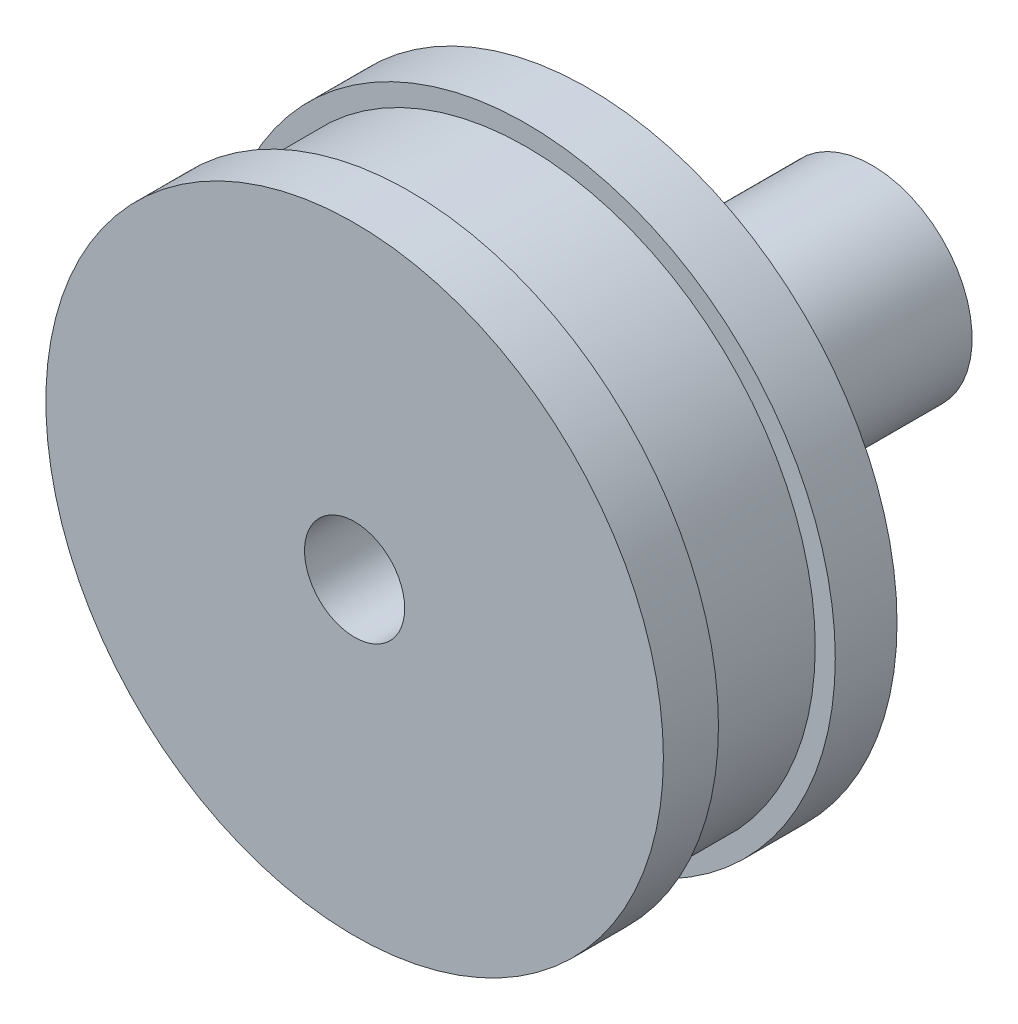
ISO-10303-21;
HEADER;
FILE_DESCRIPTION(('STEP AP214'),'2;1');
FILE_NAME('part.step','',(''),(''),'','','');
FILE_SCHEMA(('AUTOMOTIVE_DESIGN { 1 0 10303 214 1 1 1 1 }'));
ENDSEC;
DATA;
#1=APPLICATION_CONTEXT('core data for automotive mechanical design processes');
#2=APPLICATION_PROTOCOL_DEFINITION('international standard','automotive_design',2000,#1);
#3=PRODUCT_CONTEXT('',#1,'mechanical');
#4=PRODUCT('Part','Part','',(#3));
#5=PRODUCT_RELATED_PRODUCT_CATEGORY('part','',(#4));
#6=PRODUCT_DEFINITION_FORMATION('','',#4);
#7=PRODUCT_DEFINITION_CONTEXT('part definition',#1,'design');
#8=PRODUCT_DEFINITION('design','',#6,#7);
#9=PRODUCT_DEFINITION_SHAPE('','',#8);
#10=(LENGTH_UNIT() NAMED_UNIT(*) SI_UNIT(.MILLI.,.METRE.));
#11=(NAMED_UNIT(*) PLANE_ANGLE_UNIT() SI_UNIT($,.RADIAN.));
#12=(NAMED_UNIT(*) SI_UNIT($,.STERADIAN.) SOLID_ANGLE_UNIT());
#13=UNCERTAINTY_MEASURE_WITH_UNIT(LENGTH_MEASURE(1.E-05),#10,'distance_accuracy_value','');
#14=(GEOMETRIC_REPRESENTATION_CONTEXT(3) GLOBAL_UNCERTAINTY_ASSIGNED_CONTEXT((#13)) GLOBAL_UNIT_ASSIGNED_CONTEXT((#10,
#11,#12)) REPRESENTATION_CONTEXT('',''));
#15=CARTESIAN_POINT('',(0.,0.,0.));
#16=DIRECTION('',(0.,0.,1.));
#17=DIRECTION('',(1.,0.,0.));
#18=AXIS2_PLACEMENT_3D('',#15,#16,#17);
#19=CARTESIAN_POINT('',(0.,0.,14.));
#20=DIRECTION('',(0.,0.,-1.));
#21=DIRECTION('',(-1.,0.,0.));
#22=AXIS2_PLACEMENT_3D('',#19,#20,#21);
#23=CYLINDRICAL_SURFACE('',#22,18.5);
#24=CARTESIAN_POINT('',(0.,0.,0.));
#25=DIRECTION('',(0.,0.,1.));
#26=DIRECTION('',(1.,0.,0.));
#27=AXIS2_PLACEMENT_3D('',#24,#25,#26);
#28=CIRCLE('',#27,18.5);
#29=CARTESIAN_POINT('',(18.5,0.,0.));
#30=VERTEX_POINT('',#29);
#31=EDGE_CURVE('E66',#30,#30,#28,.T.);
#32=ORIENTED_EDGE('',*,*,#31,.T.);
#33=EDGE_LOOP('',(#32));
#34=FACE_BOUND('',#33,.T.);
#35=CARTESIAN_POINT('',(0.,0.,3.7));
#36=DIRECTION('',(0.,0.,1.));
#37=DIRECTION('',(1.,0.,0.));
#38=AXIS2_PLACEMENT_3D('',#35,#36,#37);
#39=CIRCLE('',#38,18.5);
#40=CARTESIAN_POINT('',(18.5,0.,3.7));
#41=VERTEX_POINT('',#40);
#42=EDGE_CURVE('E59',#41,#41,#39,.T.);
#43=ORIENTED_EDGE('',*,*,#42,.F.);
#44=EDGE_LOOP('',(#43));
#45=FACE_BOUND('',#44,.T.);
#46=ADVANCED_FACE('F31',(#34,#45),#23,.T.);
#47=CARTESIAN_POINT('',(0.,0.,14.));
#48=DIRECTION('',(0.,0.,1.));
#49=DIRECTION('',(1.,0.,0.));
#50=AXIS2_PLACEMENT_3D('',#47,#48,#49);
#51=PLANE('',#50);
#52=CARTESIAN_POINT('',(0.,0.,14.));
#53=DIRECTION('',(0.,0.,1.));
#54=DIRECTION('',(1.,0.,0.));
#55=AXIS2_PLACEMENT_3D('',#52,#53,#54);
#56=CIRCLE('',#55,18.5);
#57=CARTESIAN_POINT('',(18.5,0.,14.));
#58=VERTEX_POINT('',#57);
#59=EDGE_CURVE('E43',#58,#58,#56,.T.);
#60=ORIENTED_EDGE('',*,*,#59,.T.);
#61=EDGE_LOOP('',(#60));
#62=FACE_BOUND('',#61,.T.);
#63=CARTESIAN_POINT('',(0.,0.,14.));
#64=DIRECTION('',(0.,0.,1.));
#65=DIRECTION('',(1.,0.,0.));
#66=AXIS2_PLACEMENT_3D('',#63,#64,#65);
#67=CIRCLE('',#66,3.);
#68=CARTESIAN_POINT('',(3.,0.,14.));
#69=VERTEX_POINT('',#68);
#70=EDGE_CURVE('E63',#69,#69,#67,.T.);
#71=ORIENTED_EDGE('',*,*,#70,.F.);
#72=EDGE_LOOP('',(#71));
#73=FACE_BOUND('',#72,.T.);
#74=ADVANCED_FACE('F77',(#62,#73),#51,.T.);
#75=CARTESIAN_POINT('',(0.,0.,0.));
#76=DIRECTION('',(0.,0.,1.));
#77=DIRECTION('',(1.,0.,0.));
#78=AXIS2_PLACEMENT_3D('',#75,#76,#77);
#79=PLANE('',#78);
#80=CARTESIAN_POINT('',(0.,0.,0.));
#81=DIRECTION('',(0.,0.,1.));
#82=DIRECTION('',(1.,0.,0.));
#83=AXIS2_PLACEMENT_3D('',#80,#81,#82);
#84=CIRCLE('',#83,7.);
#85=CARTESIAN_POINT('',(7.,0.,0.));
#86=VERTEX_POINT('',#85);
#87=EDGE_CURVE('E35',#86,#86,#84,.F.);
#88=ORIENTED_EDGE('',*,*,#87,.F.);
#89=EDGE_LOOP('',(#88));
#90=FACE_BOUND('',#89,.T.);
#91=ORIENTED_EDGE('',*,*,#31,.F.);
#92=EDGE_LOOP('',(#91));
#93=FACE_BOUND('',#92,.T.);
#94=ADVANCED_FACE('F75',(#90,#93),#79,.F.);
#95=CARTESIAN_POINT('',(0.,0.,10.7));
#96=DIRECTION('',(0.,0.,1.));
#97=DIRECTION('',(1.,0.,0.));
#98=AXIS2_PLACEMENT_3D('',#95,#96,#97);
#99=CIRCLE('',#98,18.5);
#100=CARTESIAN_POINT('',(18.5,0.,10.7));
#101=VERTEX_POINT('',#100);
#102=EDGE_CURVE('E53',#101,#101,#99,.T.);
#103=ORIENTED_EDGE('',*,*,#102,.T.);
#104=EDGE_LOOP('',(#103));
#105=FACE_BOUND('',#104,.T.);
#106=ORIENTED_EDGE('',*,*,#59,.F.);
#107=EDGE_LOOP('',(#106));
#108=FACE_BOUND('',#107,.T.);
#109=ADVANCED_FACE('F33',(#105,#108),#23,.T.);
#110=CARTESIAN_POINT('',(0.,0.,14.));
#111=DIRECTION('',(0.,0.,-1.));
#112=DIRECTION('',(-1.,0.,0.));
#113=AXIS2_PLACEMENT_3D('',#110,#111,#112);
#114=CYLINDRICAL_SURFACE('',#113,3.);
#115=ORIENTED_EDGE('',*,*,#70,.T.);
#116=EDGE_LOOP('',(#115));
#117=FACE_BOUND('',#116,.T.);
#118=CARTESIAN_POINT('',(0.,0.,0.));
#119=DIRECTION('',(0.,0.,1.));
#120=DIRECTION('',(1.,0.,0.));
#121=AXIS2_PLACEMENT_3D('',#118,#119,#120);
#122=CIRCLE('',#121,3.);
#123=CARTESIAN_POINT('',(3.,0.,0.));
#124=VERTEX_POINT('',#123);
#125=EDGE_CURVE('E62',#124,#124,#122,.T.);
#126=ORIENTED_EDGE('',*,*,#125,.F.);
#127=EDGE_LOOP('',(#126));
#128=FACE_BOUND('',#127,.T.);
#129=ADVANCED_FACE('F83',(#117,#128),#114,.F.);
#130=CARTESIAN_POINT('',(0.,0.,5.5));
#131=DIRECTION('',(0.,0.,1.));
#132=DIRECTION('',(1.,0.,0.));
#133=AXIS2_PLACEMENT_3D('',#130,#131,#132);
#134=CYLINDRICAL_SURFACE('',#133,17.3);
#135=CARTESIAN_POINT('',(0.,0.,10.7));
#136=DIRECTION('',(0.,0.,1.));
#137=DIRECTION('',(1.,0.,0.));
#138=AXIS2_PLACEMENT_3D('',#135,#136,#137);
#139=CIRCLE('',#138,17.3);
#140=CARTESIAN_POINT('',(17.3,0.,10.7));
#141=VERTEX_POINT('',#140);
#142=EDGE_CURVE('E50',#141,#141,#139,.T.);
#143=ORIENTED_EDGE('',*,*,#142,.F.);
#144=EDGE_LOOP('',(#143));
#145=FACE_BOUND('',#144,.T.);
#146=CARTESIAN_POINT('',(0.,0.,3.7));
#147=DIRECTION('',(0.,0.,1.));
#148=DIRECTION('',(1.,0.,0.));
#149=AXIS2_PLACEMENT_3D('',#146,#147,#148);
#150=CIRCLE('',#149,17.3);
#151=CARTESIAN_POINT('',(17.3,0.,3.7));
#152=VERTEX_POINT('',#151);
#153=EDGE_CURVE('E56',#152,#152,#150,.T.);
#154=ORIENTED_EDGE('',*,*,#153,.T.);
#155=EDGE_LOOP('',(#154));
#156=FACE_BOUND('',#155,.T.);
#157=ADVANCED_FACE('F105',(#145,#156),#134,.T.);
#158=CARTESIAN_POINT('',(0.,0.,3.7));
#159=DIRECTION('',(0.,0.,1.));
#160=DIRECTION('',(1.,0.,0.));
#161=AXIS2_PLACEMENT_3D('',#158,#159,#160);
#162=PLANE('',#161);
#163=ORIENTED_EDGE('',*,*,#153,.F.);
#164=EDGE_LOOP('',(#163));
#165=FACE_BOUND('',#164,.T.);
#166=ORIENTED_EDGE('',*,*,#42,.T.);
#167=EDGE_LOOP('',(#166));
#168=FACE_BOUND('',#167,.T.);
#169=ADVANCED_FACE('F119',(#165,#168),#162,.T.);
#170=CARTESIAN_POINT('',(0.,0.,10.7));
#171=DIRECTION('',(0.,0.,1.));
#172=DIRECTION('',(1.,0.,0.));
#173=AXIS2_PLACEMENT_3D('',#170,#171,#172);
#174=PLANE('',#173);
#175=ORIENTED_EDGE('',*,*,#102,.F.);
#176=EDGE_LOOP('',(#175));
#177=FACE_BOUND('',#176,.T.);
#178=ORIENTED_EDGE('',*,*,#142,.T.);
#179=EDGE_LOOP('',(#178));
#180=FACE_BOUND('',#179,.T.);
#181=ADVANCED_FACE('F127',(#177,#180),#174,.F.);
#182=CARTESIAN_POINT('',(0.,0.,0.));
#183=DIRECTION('',(0.,0.,-1.));
#184=DIRECTION('',(-1.,0.,0.));
#185=AXIS2_PLACEMENT_3D('',#182,#183,#184);
#186=PLANE('',#185);
#187=ORIENTED_EDGE('',*,*,#125,.T.);
#188=EDGE_LOOP('',(#187));
#189=FACE_BOUND('',#188,.T.);
#190=ADVANCED_FACE('F134',(#189),#186,.F.);
#191=CARTESIAN_POINT('',(0.,0.,-5.));
#192=DIRECTION('',(0.,0.,1.));
#193=DIRECTION('',(1.,0.,0.));
#194=AXIS2_PLACEMENT_3D('',#191,#192,#193);
#195=CYLINDRICAL_SURFACE('',#194,7.);
#196=CARTESIAN_POINT('',(0.,0.,-5.));
#197=DIRECTION('',(0.,0.,-1.));
#198=DIRECTION('',(-1.,0.,0.));
#199=AXIS2_PLACEMENT_3D('',#196,#197,#198);
#200=CIRCLE('',#199,7.);
#201=CARTESIAN_POINT('',(-7.,0.,-5.));
#202=VERTEX_POINT('',#201);
#203=EDGE_CURVE('E47',#202,#202,#200,.T.);
#204=ORIENTED_EDGE('',*,*,#203,.F.);
#205=EDGE_LOOP('',(#204));
#206=FACE_BOUND('',#205,.T.);
#207=ORIENTED_EDGE('',*,*,#87,.T.);
#208=EDGE_LOOP('',(#207));
#209=FACE_BOUND('',#208,.T.);
#210=ADVANCED_FACE('F142',(#206,#209),#195,.T.);
#211=CARTESIAN_POINT('',(0.,0.,-5.));
#212=DIRECTION('',(0.,0.,-1.));
#213=DIRECTION('',(-1.,0.,0.));
#214=AXIS2_PLACEMENT_3D('',#211,#212,#213);
#215=PLANE('',#214);
#216=CARTESIAN_POINT('',(0.,0.,-5.));
#217=DIRECTION('',(0.,0.,-1.));
#218=DIRECTION('',(-1.,0.,0.));
#219=AXIS2_PLACEMENT_3D('',#216,#217,#218);
#220=CIRCLE('',#219,6.);
#221=CARTESIAN_POINT('',(-6.,0.,-5.));
#222=VERTEX_POINT('',#221);
#223=EDGE_CURVE('E10',#222,#222,#220,.T.);
#224=ORIENTED_EDGE('',*,*,#223,.F.);
#225=EDGE_LOOP('',(#224));
#226=FACE_BOUND('',#225,.T.);
#227=ORIENTED_EDGE('',*,*,#203,.T.);
#228=EDGE_LOOP('',(#227));
#229=FACE_BOUND('',#228,.T.);
#230=ADVANCED_FACE('F150',(#226,#229),#215,.T.);
#231=CARTESIAN_POINT('',(0.,0.,-17.));
#232=DIRECTION('',(0.,0.,1.));
#233=DIRECTION('',(1.,0.,0.));
#234=AXIS2_PLACEMENT_3D('',#231,#232,#233);
#235=CYLINDRICAL_SURFACE('',#234,6.);
#236=CARTESIAN_POINT('',(0.,0.,-17.));
#237=DIRECTION('',(0.,0.,-1.));
#238=DIRECTION('',(-1.,0.,0.));
#239=AXIS2_PLACEMENT_3D('',#236,#237,#238);
#240=CIRCLE('',#239,6.);
#241=CARTESIAN_POINT('',(-6.,0.,-17.));
#242=VERTEX_POINT('',#241);
#243=EDGE_CURVE('E46',#242,#242,#240,.T.);
#244=ORIENTED_EDGE('',*,*,#243,.F.);
#245=EDGE_LOOP('',(#244));
#246=FACE_BOUND('',#245,.T.);
#247=ORIENTED_EDGE('',*,*,#223,.T.);
#248=EDGE_LOOP('',(#247));
#249=FACE_BOUND('',#248,.T.);
#250=ADVANCED_FACE('F158',(#246,#249),#235,.T.);
#251=CARTESIAN_POINT('',(0.,0.,-17.));
#252=DIRECTION('',(0.,0.,-1.));
#253=DIRECTION('',(-1.,0.,0.));
#254=AXIS2_PLACEMENT_3D('',#251,#252,#253);
#255=PLANE('',#254);
#256=ORIENTED_EDGE('',*,*,#243,.T.);
#257=EDGE_LOOP('',(#256));
#258=FACE_BOUND('',#257,.T.);
#259=ADVANCED_FACE('F166',(#258),#255,.T.);
#260=CLOSED_SHELL('',(#46,#74,#94,#109,#129,#157,#169,#181,#190,#210,#230,#250,#259));
#261=MANIFOLD_SOLID_BREP('B2',#260);
#262=ADVANCED_BREP_SHAPE_REPRESENTATION('',(#18,#261),#14);
#263=SHAPE_DEFINITION_REPRESENTATION(#9,#262);
ENDSEC;
END-ISO-10303-21;
